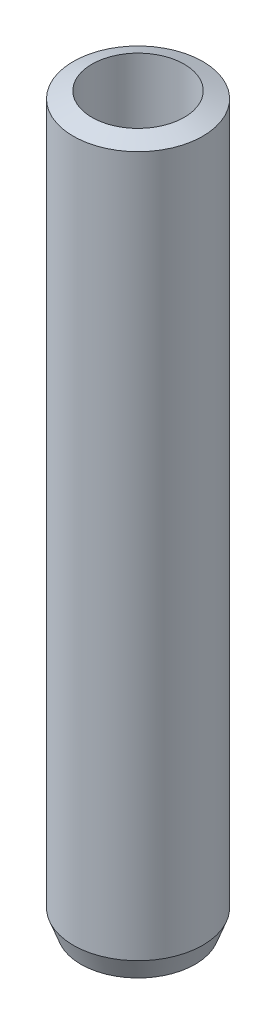
ISO-10303-21;
HEADER;
FILE_DESCRIPTION(('STEP AP214'),'2;1');
FILE_NAME('part.step','',(''),(''),'','','');
FILE_SCHEMA(('AUTOMOTIVE_DESIGN { 1 0 10303 214 1 1 1 1 }'));
ENDSEC;
DATA;
#1=APPLICATION_CONTEXT('core data for automotive mechanical design processes');
#2=APPLICATION_PROTOCOL_DEFINITION('international standard','automotive_design',2000,#1);
#3=PRODUCT_CONTEXT('',#1,'mechanical');
#4=PRODUCT('Part','Part','',(#3));
#5=PRODUCT_RELATED_PRODUCT_CATEGORY('part','',(#4));
#6=PRODUCT_DEFINITION_FORMATION('','',#4);
#7=PRODUCT_DEFINITION_CONTEXT('part definition',#1,'design');
#8=PRODUCT_DEFINITION('design','',#6,#7);
#9=PRODUCT_DEFINITION_SHAPE('','',#8);
#10=(LENGTH_UNIT() NAMED_UNIT(*) SI_UNIT(.MILLI.,.METRE.));
#11=(NAMED_UNIT(*) PLANE_ANGLE_UNIT() SI_UNIT($,.RADIAN.));
#12=(NAMED_UNIT(*) SI_UNIT($,.STERADIAN.) SOLID_ANGLE_UNIT());
#13=UNCERTAINTY_MEASURE_WITH_UNIT(LENGTH_MEASURE(1.E-05),#10,'distance_accuracy_value','');
#14=(GEOMETRIC_REPRESENTATION_CONTEXT(3) GLOBAL_UNCERTAINTY_ASSIGNED_CONTEXT((#13)) GLOBAL_UNIT_ASSIGNED_CONTEXT((#10,
#11,#12)) REPRESENTATION_CONTEXT('',''));
#15=CARTESIAN_POINT('',(0.,0.,0.));
#16=DIRECTION('',(0.,0.,1.));
#17=DIRECTION('',(1.,0.,0.));
#18=AXIS2_PLACEMENT_3D('',#15,#16,#17);
#19=CARTESIAN_POINT('',(0.,562.517728441836,0.));
#20=DIRECTION('',(0.,-1.,0.));
#21=DIRECTION('',(0.,0.,-1.));
#22=AXIS2_PLACEMENT_3D('',#19,#20,#21);
#23=CYLINDRICAL_SURFACE('',#22,50.);
#24=CARTESIAN_POINT('',(0.,556.616615179292,0.));
#25=DIRECTION('',(0.,1.,0.));
#26=DIRECTION('',(0.,0.,1.));
#27=AXIS2_PLACEMENT_3D('',#24,#25,#26);
#28=CIRCLE('',#27,50.);
#29=CARTESIAN_POINT('',(0.,556.616615179292,-50.0000000000002));
#30=VERTEX_POINT('',#29);
#31=EDGE_CURVE('E50',#30,#30,#28,.F.);
#32=ORIENTED_EDGE('',*,*,#31,.T.);
#33=EDGE_LOOP('',(#32));
#34=FACE_BOUND('',#33,.T.);
#35=CARTESIAN_POINT('',(0.,15.7413568960479,0.));
#36=DIRECTION('',(0.,1.,0.));
#37=DIRECTION('',(0.,0.,1.));
#38=AXIS2_PLACEMENT_3D('',#35,#36,#37);
#39=CIRCLE('',#38,50.);
#40=CARTESIAN_POINT('',(0.,15.7413568960479,50.));
#41=VERTEX_POINT('',#40);
#42=EDGE_CURVE('E51',#41,#41,#39,.T.);
#43=ORIENTED_EDGE('',*,*,#42,.T.);
#44=EDGE_LOOP('',(#43));
#45=FACE_BOUND('',#44,.T.);
#46=ADVANCED_FACE('F39',(#34,#45),#23,.T.);
#47=CARTESIAN_POINT('',(0.,0.,0.));
#48=DIRECTION('',(0.,1.,0.));
#49=DIRECTION('',(0.,0.,1.));
#50=AXIS2_PLACEMENT_3D('',#47,#48,#49);
#51=PLANE('',#50);
#52=CARTESIAN_POINT('',(0.,0.,0.));
#53=DIRECTION('',(0.,1.,0.));
#54=DIRECTION('',(0.,0.,1.));
#55=AXIS2_PLACEMENT_3D('',#52,#53,#54);
#56=CIRCLE('',#55,44.0988867374557);
#57=CARTESIAN_POINT('',(0.,0.,44.0988867374557));
#58=VERTEX_POINT('',#57);
#59=EDGE_CURVE('E10',#58,#58,#56,.F.);
#60=ORIENTED_EDGE('',*,*,#59,.T.);
#61=EDGE_LOOP('',(#60));
#62=FACE_BOUND('',#61,.T.);
#63=CARTESIAN_POINT('',(0.,0.,0.));
#64=DIRECTION('',(0.,1.,0.));
#65=DIRECTION('',(0.,0.,1.));
#66=AXIS2_PLACEMENT_3D('',#63,#64,#65);
#67=CIRCLE('',#66,35.6215304385882);
#68=CARTESIAN_POINT('',(0.,0.,35.6215304385882));
#69=VERTEX_POINT('',#68);
#70=EDGE_CURVE('E58',#69,#69,#67,.T.);
#71=ORIENTED_EDGE('',*,*,#70,.T.);
#72=EDGE_LOOP('',(#71));
#73=FACE_BOUND('',#72,.T.);
#74=ADVANCED_FACE('F62',(#62,#73),#51,.F.);
#75=CARTESIAN_POINT('',(0.,562.517728441836,0.));
#76=DIRECTION('',(0.,-1.,0.));
#77=DIRECTION('',(0.,0.,-1.));
#78=AXIS2_PLACEMENT_3D('',#75,#76,#77);
#79=CYLINDRICAL_SURFACE('',#78,35.6215304385882);
#80=CARTESIAN_POINT('',(0.,562.006809810178,0.));
#81=DIRECTION('',(0.,-1.,0.));
#82=DIRECTION('',(0.,0.,-1.));
#83=AXIS2_PLACEMENT_3D('',#80,#81,#82);
#84=CIRCLE('',#83,35.6215304385882);
#85=CARTESIAN_POINT('',(0.,562.006809810178,-35.6215304385879));
#86=VERTEX_POINT('',#85);
#87=EDGE_CURVE('E54',#86,#86,#84,.F.);
#88=ORIENTED_EDGE('',*,*,#87,.T.);
#89=EDGE_LOOP('',(#88));
#90=FACE_BOUND('',#89,.T.);
#91=ORIENTED_EDGE('',*,*,#70,.F.);
#92=EDGE_LOOP('',(#91));
#93=FACE_BOUND('',#92,.T.);
#94=ADVANCED_FACE('F68',(#90,#93),#79,.F.);
#95=CARTESIAN_POINT('',(0.,562.517728441836,0.));
#96=DIRECTION('',(0.,-1.,0.));
#97=DIRECTION('',(0.,0.,-1.));
#98=AXIS2_PLACEMENT_3D('',#95,#96,#97);
#99=CONICAL_SURFACE('',#98,34.2586431039514,1.2121312343621);
#100=CARTESIAN_POINT('',(0.,556.616615179292,-50.0000000000002));
#101=CARTESIAN_POINT('',(0.,556.67276304003,-49.8502242754021));
#102=CARTESIAN_POINT('',(0.,556.728910900769,-49.700448550804));
#103=CARTESIAN_POINT('',(0.,556.841206622245,-49.400897101608));
#104=CARTESIAN_POINT('',(0.,556.897354482984,-49.2511213770099));
#105=CARTESIAN_POINT('',(0.,557.009650204461,-48.9515699278138));
#106=CARTESIAN_POINT('',(0.,557.065798065199,-48.8017942032158));
#107=CARTESIAN_POINT('',(0.,557.178093786676,-48.5022427540197));
#108=CARTESIAN_POINT('',(0.,557.234241647414,-48.3524670294217));
#109=CARTESIAN_POINT('',(0.,557.346537368891,-48.0529155802256));
#110=CARTESIAN_POINT('',(0.,557.402685229629,-47.9031398556275));
#111=CARTESIAN_POINT('',(0.,557.514980951106,-47.6035884064314));
#112=CARTESIAN_POINT('',(0.,557.571128811845,-47.4538126818334));
#113=CARTESIAN_POINT('',(0.,557.683424533321,-47.1542612326373));
#114=CARTESIAN_POINT('',(0.,557.73957239406,-47.0044855080393));
#115=CARTESIAN_POINT('',(0.,557.851868115536,-46.7049340588432));
#116=CARTESIAN_POINT('',(0.,557.908015976275,-46.5551583342451));
#117=CARTESIAN_POINT('',(0.,558.020311697752,-46.255606885049));
#118=CARTESIAN_POINT('',(0.,558.07645955849,-46.105831160451));
#119=CARTESIAN_POINT('',(0.,558.188755279967,-45.8062797112549));
#120=CARTESIAN_POINT('',(0.,558.244903140705,-45.6565039866569));
#121=CARTESIAN_POINT('',(0.,558.357198862182,-45.3569525374608));
#122=CARTESIAN_POINT('',(0.,558.41334672292,-45.2071768128627));
#123=CARTESIAN_POINT('',(0.,558.525642444397,-44.9076253636666));
#124=CARTESIAN_POINT('',(0.,558.581790305136,-44.7578496390686));
#125=CARTESIAN_POINT('',(0.,558.694086026612,-44.4582981898725));
#126=CARTESIAN_POINT('',(0.,558.750233887351,-44.3085224652745));
#127=CARTESIAN_POINT('',(0.,558.862529608828,-44.0089710160784));
#128=CARTESIAN_POINT('',(0.,558.918677469566,-43.8591952914803));
#129=CARTESIAN_POINT('',(0.,559.030973191043,-43.5596438422842));
#130=CARTESIAN_POINT('',(0.,559.087121051781,-43.4098681176862));
#131=CARTESIAN_POINT('',(0.,559.199416773258,-43.1103166684901));
#132=CARTESIAN_POINT('',(0.,559.255564633996,-42.9605409438921));
#133=CARTESIAN_POINT('',(0.,559.367860355473,-42.660989494696));
#134=CARTESIAN_POINT('',(0.,559.424008216212,-42.5112137700979));
#135=CARTESIAN_POINT('',(0.,559.536303937688,-42.2116623209018));
#136=CARTESIAN_POINT('',(0.,559.592451798427,-42.0618865963038));
#137=CARTESIAN_POINT('',(0.,559.704747519904,-41.7623351471077));
#138=CARTESIAN_POINT('',(0.,559.760895380642,-41.6125594225097));
#139=CARTESIAN_POINT('',(0.,559.873191102119,-41.3130079733136));
#140=CARTESIAN_POINT('',(0.,559.929338962857,-41.1632322487155));
#141=CARTESIAN_POINT('',(0.,560.041634684334,-40.8636807995194));
#142=CARTESIAN_POINT('',(0.,560.097782545072,-40.7139050749214));
#143=CARTESIAN_POINT('',(0.,560.210078266549,-40.4143536257253));
#144=CARTESIAN_POINT('',(0.,560.266226127287,-40.2645779011272));
#145=CARTESIAN_POINT('',(0.,560.378521848764,-39.9650264519312));
#146=CARTESIAN_POINT('',(0.,560.434669709503,-39.8152507273331));
#147=CARTESIAN_POINT('',(0.,560.54696543098,-39.515699278137));
#148=CARTESIAN_POINT('',(0.,560.603113291718,-39.365923553539));
#149=CARTESIAN_POINT('',(0.,560.715409013195,-39.0663721043429));
#150=CARTESIAN_POINT('',(0.,560.771556873933,-38.9165963797449));
#151=CARTESIAN_POINT('',(0.,560.88385259541,-38.6170449305488));
#152=CARTESIAN_POINT('',(0.,560.940000456148,-38.4672692059507));
#153=CARTESIAN_POINT('',(0.,561.052296177625,-38.1677177567546));
#154=CARTESIAN_POINT('',(0.,561.108444038363,-38.0179420321566));
#155=CARTESIAN_POINT('',(0.,561.22073975984,-37.7183905829605));
#156=CARTESIAN_POINT('',(0.,561.276887620579,-37.5686148583624));
#157=CARTESIAN_POINT('',(0.,561.389183342055,-37.2690634091663));
#158=CARTESIAN_POINT('',(0.,561.445331202794,-37.1192876845683));
#159=CARTESIAN_POINT('',(0.,561.557626924271,-36.8197362353722));
#160=CARTESIAN_POINT('',(0.,561.613774785009,-36.6699605107742));
#161=CARTESIAN_POINT('',(0.,561.726070506486,-36.3704090615781));
#162=CARTESIAN_POINT('',(0.,561.782218367224,-36.22063333698));
#163=CARTESIAN_POINT('',(0.,561.894514088701,-35.921081887784));
#164=CARTESIAN_POINT('',(0.,561.950661949439,-35.7713061631859));
#165=CARTESIAN_POINT('',(0.,562.006809810178,-35.6215304385879));
#166=B_SPLINE_CURVE_WITH_KNOTS('',3,(#100,#101,#102,#103,#104,#105,#106,#107,#108,#109,#110,
#111,#112,#113,#114,#115,#116,#117,#118,#119,#120,#121,#122,#123,#124,#125,#126,#127,#128,#129,
#130,#131,#132,#133,#134,#135,#136,#137,#138,#139,#140,#141,#142,#143,#144,#145,#146,#147,#148,
#149,#150,#151,#152,#153,#154,#155,#156,#157,#158,#159,#160,#161,#162,#163,#164,#165),
.UNSPECIFIED.,.F.,.F.,(4,2,2,2,2,2,2,2,2,2,2,2,2,2,2,2,2,2,2,2,2,2,2,2,2,2,2,2,2,2,2,2,4),(0.,
0.479862636073379,0.95972527214679,1.43958790822017,1.91945054429358,2.39931318036695,
2.87917581644037,3.35903845251374,3.83890108858716,4.31876372466053,4.79862636073394,
5.27848899680732,5.75835163288073,6.23821426895411,6.71807690502752,7.1979395411009,
7.67780217717431,8.15766481324773,8.6375274493211,9.11739008539451,9.59725272146789,
10.0771153575413,10.5569779936147,11.0368406296881,11.5167032657615,11.9965659018349,
12.4764285379083,12.9562911739817,13.436153810055,13.9160164461285,14.3958790822018,
14.8757417182752,15.3556043543487),.UNSPECIFIED.);
#167=EDGE_CURVE('BSEAM66',#30,#86,#166,.T.);
#168=ORIENTED_EDGE('',*,*,#31,.F.);
#169=ORIENTED_EDGE('',*,*,#87,.F.);
#170=ORIENTED_EDGE('',*,*,#167,.T.);
#171=ORIENTED_EDGE('',*,*,#167,.F.);
#172=EDGE_LOOP('',(#168,#170,#169,#171));
#173=FACE_BOUND('',#172,.T.);
#174=ADVANCED_FACE('F66',(#173),#99,.T.);
#175=CARTESIAN_POINT('',(0.,15.7413568960479,0.));
#176=DIRECTION('',(0.,1.,0.));
#177=DIRECTION('',(0.,0.,1.));
#178=AXIS2_PLACEMENT_3D('',#175,#176,#177);
#179=CONICAL_SURFACE('',#178,50.,0.358665092432802);
#180=ORIENTED_EDGE('',*,*,#59,.F.);
#181=EDGE_LOOP('',(#180));
#182=FACE_BOUND('',#181,.T.);
#183=ORIENTED_EDGE('',*,*,#42,.F.);
#184=EDGE_LOOP('',(#183));
#185=FACE_BOUND('',#184,.T.);
#186=ADVANCED_FACE('F45',(#182,#185),#179,.T.);
#187=CLOSED_SHELL('',(#46,#74,#94,#174,#186));
#188=MANIFOLD_SOLID_BREP('B2',#187);
#189=ADVANCED_BREP_SHAPE_REPRESENTATION('',(#18,#188),#14);
#190=SHAPE_DEFINITION_REPRESENTATION(#9,#189);
ENDSEC;
END-ISO-10303-21;
